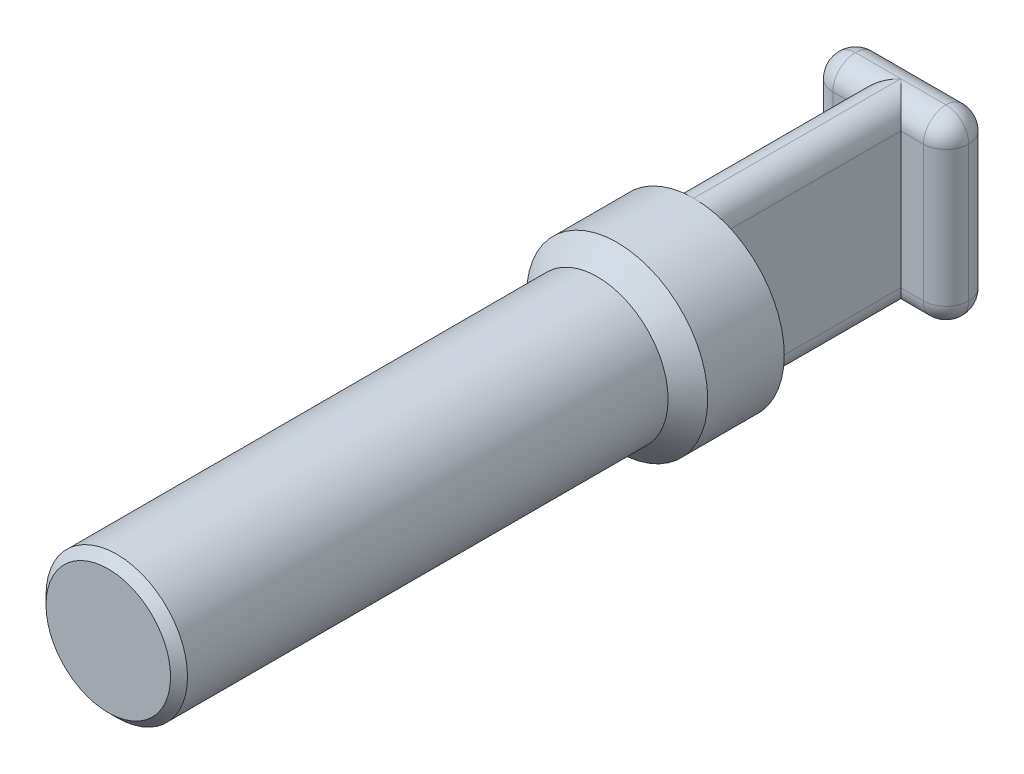
ISO-10303-21;
HEADER;
FILE_DESCRIPTION(('STEP AP214'),'2;1');
FILE_NAME('part.step','',(''),(''),'','','');
FILE_SCHEMA(('AUTOMOTIVE_DESIGN { 1 0 10303 214 1 1 1 1 }'));
ENDSEC;
DATA;
#1=APPLICATION_CONTEXT('core data for automotive mechanical design processes');
#2=APPLICATION_PROTOCOL_DEFINITION('international standard','automotive_design',2000,#1);
#3=PRODUCT_CONTEXT('',#1,'mechanical');
#4=PRODUCT('Part','Part','',(#3));
#5=PRODUCT_RELATED_PRODUCT_CATEGORY('part','',(#4));
#6=PRODUCT_DEFINITION_FORMATION('','',#4);
#7=PRODUCT_DEFINITION_CONTEXT('part definition',#1,'design');
#8=PRODUCT_DEFINITION('design','',#6,#7);
#9=PRODUCT_DEFINITION_SHAPE('','',#8);
#10=(LENGTH_UNIT() NAMED_UNIT(*) SI_UNIT(.MILLI.,.METRE.));
#11=(NAMED_UNIT(*) PLANE_ANGLE_UNIT() SI_UNIT($,.RADIAN.));
#12=(NAMED_UNIT(*) SI_UNIT($,.STERADIAN.) SOLID_ANGLE_UNIT());
#13=UNCERTAINTY_MEASURE_WITH_UNIT(LENGTH_MEASURE(1.E-05),#10,'distance_accuracy_value','');
#14=(GEOMETRIC_REPRESENTATION_CONTEXT(3) GLOBAL_UNCERTAINTY_ASSIGNED_CONTEXT((#13)) GLOBAL_UNIT_ASSIGNED_CONTEXT((#10,
#11,#12)) REPRESENTATION_CONTEXT('',''));
#15=CARTESIAN_POINT('',(0.,0.,0.));
#16=DIRECTION('',(0.,0.,1.));
#17=DIRECTION('',(1.,0.,0.));
#18=AXIS2_PLACEMENT_3D('',#15,#16,#17);
#19=CARTESIAN_POINT('',(-1.016,4.064,-18.288));
#20=DIRECTION('',(1.,0.,0.));
#21=DIRECTION('',(0.,0.,-1.));
#22=AXIS2_PLACEMENT_3D('',#19,#20,#21);
#23=PLANE('',#22);
#24=DIRECTION('',(0.,1.,0.));
#25=VECTOR('',#24,1.);
#26=CARTESIAN_POINT('',(-1.016,4.064,-16.256));
#27=LINE('',#26,#25);
#28=CARTESIAN_POINT('',(-1.016,-3.048,-16.256));
#29=VERTEX_POINT('',#28);
#30=CARTESIAN_POINT('',(-1.016,3.048,-16.256));
#31=VERTEX_POINT('',#30);
#32=EDGE_CURVE('E266',#29,#31,#27,.T.);
#33=ORIENTED_EDGE('',*,*,#32,.F.);
#34=DIRECTION('',(0.,0.,1.));
#35=VECTOR('',#34,1.);
#36=CARTESIAN_POINT('',(-1.016,-3.048,-18.288));
#37=LINE('',#36,#35);
#38=CARTESIAN_POINT('',(-1.016,-3.048,-7.98195));
#39=VERTEX_POINT('',#38);
#40=EDGE_CURVE('E157',#29,#39,#37,.T.);
#41=ORIENTED_EDGE('',*,*,#40,.T.);
#42=DIRECTION('',(0.,1.,0.));
#43=VECTOR('',#42,1.);
#44=CARTESIAN_POINT('',(-1.016,4.064,-7.98195));
#45=LINE('',#44,#43);
#46=CARTESIAN_POINT('',(-1.016,3.048,-7.98195));
#47=VERTEX_POINT('',#46);
#48=EDGE_CURVE('E148',#39,#47,#45,.T.);
#49=ORIENTED_EDGE('',*,*,#48,.T.);
#50=DIRECTION('',(0.,0.,1.));
#51=VECTOR('',#50,1.);
#52=CARTESIAN_POINT('',(-1.016,3.048,-18.288));
#53=LINE('',#52,#51);
#54=EDGE_CURVE('E154',#47,#31,#53,.F.);
#55=ORIENTED_EDGE('',*,*,#54,.T.);
#56=EDGE_LOOP('',(#33,#41,#49,#55));
#57=FACE_BOUND('',#56,.T.);
#58=ADVANCED_FACE('F36',(#57),#23,.F.);
#59=CARTESIAN_POINT('',(1.016,4.064,-18.288));
#60=DIRECTION('',(-1.,0.,0.));
#61=DIRECTION('',(0.,0.,1.));
#62=AXIS2_PLACEMENT_3D('',#59,#60,#61);
#63=PLANE('',#62);
#64=DIRECTION('',(0.,-1.,0.));
#65=VECTOR('',#64,1.);
#66=CARTESIAN_POINT('',(1.016,4.064,-7.98195));
#67=LINE('',#66,#65);
#68=CARTESIAN_POINT('',(1.016,3.048,-7.98195));
#69=VERTEX_POINT('',#68);
#70=CARTESIAN_POINT('',(1.016,-3.048,-7.98195));
#71=VERTEX_POINT('',#70);
#72=EDGE_CURVE('E158',#69,#71,#67,.T.);
#73=ORIENTED_EDGE('',*,*,#72,.T.);
#74=DIRECTION('',(0.,0.,1.));
#75=VECTOR('',#74,1.);
#76=CARTESIAN_POINT('',(1.016,-3.048,-18.288));
#77=LINE('',#76,#75);
#78=CARTESIAN_POINT('',(1.016,-3.048,-16.256));
#79=VERTEX_POINT('',#78);
#80=EDGE_CURVE('E166',#71,#79,#77,.F.);
#81=ORIENTED_EDGE('',*,*,#80,.T.);
#82=DIRECTION('',(0.,-1.,0.));
#83=VECTOR('',#82,1.);
#84=CARTESIAN_POINT('',(1.016,4.064,-16.256));
#85=LINE('',#84,#83);
#86=CARTESIAN_POINT('',(1.016,3.048,-16.256));
#87=VERTEX_POINT('',#86);
#88=EDGE_CURVE('E275',#87,#79,#85,.T.);
#89=ORIENTED_EDGE('',*,*,#88,.F.);
#90=DIRECTION('',(0.,0.,1.));
#91=VECTOR('',#90,1.);
#92=CARTESIAN_POINT('',(1.016,3.048,-18.288));
#93=LINE('',#92,#91);
#94=EDGE_CURVE('E170',#87,#69,#93,.T.);
#95=ORIENTED_EDGE('',*,*,#94,.T.);
#96=EDGE_LOOP('',(#73,#81,#89,#95));
#97=FACE_BOUND('',#96,.T.);
#98=ADVANCED_FACE('F313',(#97),#63,.F.);
#99=CARTESIAN_POINT('',(0.,4.064,-7.98195));
#100=DIRECTION('',(0.,0.,-1.));
#101=DIRECTION('',(-1.,0.,0.));
#102=AXIS2_PLACEMENT_3D('',#99,#100,#101);
#103=PLANE('',#102);
#104=ORIENTED_EDGE('',*,*,#72,.F.);
#105=CARTESIAN_POINT('',(0.,3.048,-7.98195));
#106=DIRECTION('',(0.,0.,-1.));
#107=DIRECTION('',(-1.,0.,0.));
#108=AXIS2_PLACEMENT_3D('',#105,#106,#107);
#109=CIRCLE('',#108,1.016);
#110=CARTESIAN_POINT('',(0.,4.064,-7.98195));
#111=VERTEX_POINT('',#110);
#112=EDGE_CURVE('E47',#69,#111,#109,.F.);
#113=ORIENTED_EDGE('',*,*,#112,.T.);
#114=CARTESIAN_POINT('',(0.,0.,-7.98195));
#115=DIRECTION('',(0.,0.,1.));
#116=DIRECTION('',(1.,0.,0.));
#117=AXIS2_PLACEMENT_3D('',#114,#115,#116);
#118=CIRCLE('',#117,4.064);
#119=CARTESIAN_POINT('',(0.,-4.064,-7.98195));
#120=VERTEX_POINT('',#119);
#121=EDGE_CURVE('E269',#120,#111,#118,.T.);
#122=ORIENTED_EDGE('',*,*,#121,.F.);
#123=CARTESIAN_POINT('',(0.,-3.048,-7.98195));
#124=DIRECTION('',(0.,0.,-1.));
#125=DIRECTION('',(-1.,0.,0.));
#126=AXIS2_PLACEMENT_3D('',#123,#124,#125);
#127=CIRCLE('',#126,1.016);
#128=EDGE_CURVE('E168',#120,#71,#127,.F.);
#129=ORIENTED_EDGE('',*,*,#128,.T.);
#130=EDGE_LOOP('',(#104,#113,#122,#129));
#131=FACE_BOUND('',#130,.T.);
#132=ADVANCED_FACE('F318',(#131),#103,.T.);
#133=CARTESIAN_POINT('',(0.,0.,0.));
#134=DIRECTION('',(0.,0.,1.));
#135=DIRECTION('',(1.,0.,0.));
#136=AXIS2_PLACEMENT_3D('',#133,#134,#135);
#137=CYLINDRICAL_SURFACE('',#136,4.064);
#138=CARTESIAN_POINT('',(0.,0.,-4.5466));
#139=DIRECTION('',(0.,0.,1.));
#140=DIRECTION('',(1.,0.,0.));
#141=AXIS2_PLACEMENT_3D('',#138,#139,#140);
#142=CIRCLE('',#141,4.064);
#143=CARTESIAN_POINT('',(4.064,0.,-4.5466));
#144=VERTEX_POINT('',#143);
#145=EDGE_CURVE('E280',#144,#144,#142,.T.);
#146=ORIENTED_EDGE('',*,*,#145,.F.);
#147=EDGE_LOOP('',(#146));
#148=FACE_BOUND('',#147,.T.);
#149=ORIENTED_EDGE('',*,*,#121,.T.);
#150=EDGE_CURVE('E55',#111,#120,#118,.T.);
#151=ORIENTED_EDGE('',*,*,#150,.T.);
#152=EDGE_LOOP('',(#149,#151));
#153=FACE_BOUND('',#152,.T.);
#154=ADVANCED_FACE('F407',(#148,#153),#137,.T.);
#155=CARTESIAN_POINT('',(0.,0.,-4.5466));
#156=DIRECTION('',(0.,0.,-1.));
#157=DIRECTION('',(-1.,0.,0.));
#158=AXIS2_PLACEMENT_3D('',#155,#156,#157);
#159=CONICAL_SURFACE('',#158,4.064,0.78539816339745);
#160=CARTESIAN_POINT('',(0.,0.,-3.6576));
#161=DIRECTION('',(0.,0.,1.));
#162=DIRECTION('',(1.,0.,0.));
#163=AXIS2_PLACEMENT_3D('',#160,#161,#162);
#164=CIRCLE('',#163,3.175);
#165=CARTESIAN_POINT('',(3.175,0.,-3.6576));
#166=VERTEX_POINT('',#165);
#167=EDGE_CURVE('E277',#166,#166,#164,.T.);
#168=ORIENTED_EDGE('',*,*,#167,.F.);
#169=EDGE_LOOP('',(#168));
#170=FACE_BOUND('',#169,.T.);
#171=ORIENTED_EDGE('',*,*,#145,.T.);
#172=EDGE_LOOP('',(#171));
#173=FACE_BOUND('',#172,.T.);
#174=ADVANCED_FACE('F403',(#170,#173),#159,.T.);
#175=CARTESIAN_POINT('',(0.,0.,0.));
#176=DIRECTION('',(0.,0.,1.));
#177=DIRECTION('',(1.,0.,0.));
#178=AXIS2_PLACEMENT_3D('',#175,#176,#177);
#179=CYLINDRICAL_SURFACE('',#178,3.175);
#180=CARTESIAN_POINT('',(0.,0.,17.907));
#181=DIRECTION('',(0.,0.,-1.));
#182=DIRECTION('',(-1.,0.,0.));
#183=AXIS2_PLACEMENT_3D('',#180,#181,#182);
#184=CIRCLE('',#183,3.175);
#185=CARTESIAN_POINT('',(-3.175,0.,17.907));
#186=VERTEX_POINT('',#185);
#187=EDGE_CURVE('E159',#186,#186,#184,.T.);
#188=ORIENTED_EDGE('',*,*,#187,.T.);
#189=EDGE_LOOP('',(#188));
#190=FACE_BOUND('',#189,.T.);
#191=ORIENTED_EDGE('',*,*,#167,.T.);
#192=EDGE_LOOP('',(#191));
#193=FACE_BOUND('',#192,.T.);
#194=ADVANCED_FACE('F399',(#190,#193),#179,.T.);
#195=CARTESIAN_POINT('',(0.,3.175,18.288));
#196=DIRECTION('',(0.,0.,-1.));
#197=DIRECTION('',(-1.,0.,0.));
#198=AXIS2_PLACEMENT_3D('',#195,#196,#197);
#199=PLANE('',#198);
#200=CARTESIAN_POINT('',(0.,0.,18.288));
#201=DIRECTION('',(0.,0.,-1.));
#202=DIRECTION('',(-1.,0.,0.));
#203=AXIS2_PLACEMENT_3D('',#200,#201,#202);
#204=CIRCLE('',#203,2.794);
#205=CARTESIAN_POINT('',(-2.794,0.,18.288));
#206=VERTEX_POINT('',#205);
#207=EDGE_CURVE('E283',#206,#206,#204,.F.);
#208=ORIENTED_EDGE('',*,*,#207,.T.);
#209=EDGE_LOOP('',(#208));
#210=FACE_BOUND('',#209,.T.);
#211=ADVANCED_FACE('F396',(#210),#199,.F.);
#212=CARTESIAN_POINT('',(0.,0.,18.288));
#213=DIRECTION('',(0.,0.,-1.));
#214=DIRECTION('',(-1.,0.,0.));
#215=AXIS2_PLACEMENT_3D('',#212,#213,#214);
#216=CONICAL_SURFACE('',#215,2.794,0.785398163397447);
#217=ORIENTED_EDGE('',*,*,#187,.F.);
#218=EDGE_LOOP('',(#217));
#219=FACE_BOUND('',#218,.T.);
#220=ORIENTED_EDGE('',*,*,#207,.F.);
#221=EDGE_LOOP('',(#220));
#222=FACE_BOUND('',#221,.T.);
#223=ADVANCED_FACE('F395',(#219,#222),#216,.T.);
#224=ORIENTED_EDGE('',*,*,#48,.F.);
#225=CARTESIAN_POINT('',(0.,-3.048,-7.98195));
#226=DIRECTION('',(0.,0.,-1.));
#227=DIRECTION('',(-1.,0.,0.));
#228=AXIS2_PLACEMENT_3D('',#225,#226,#227);
#229=CIRCLE('',#228,1.016);
#230=EDGE_CURVE('E176',#39,#120,#229,.F.);
#231=ORIENTED_EDGE('',*,*,#230,.T.);
#232=ORIENTED_EDGE('',*,*,#150,.F.);
#233=CARTESIAN_POINT('',(0.,3.048,-7.98195));
#234=DIRECTION('',(0.,0.,-1.));
#235=DIRECTION('',(-1.,0.,0.));
#236=AXIS2_PLACEMENT_3D('',#233,#234,#235);
#237=CIRCLE('',#236,1.016);
#238=EDGE_CURVE('E11',#111,#47,#237,.F.);
#239=ORIENTED_EDGE('',*,*,#238,.T.);
#240=EDGE_LOOP('',(#224,#231,#232,#239));
#241=FACE_BOUND('',#240,.T.);
#242=ADVANCED_FACE('F147',(#241),#103,.T.);
#243=CARTESIAN_POINT('',(-1.016,-4.064,-18.288));
#244=DIRECTION('',(0.,0.,1.));
#245=DIRECTION('',(1.,0.,0.));
#246=AXIS2_PLACEMENT_3D('',#243,#244,#245);
#247=PLANE('',#246);
#248=DIRECTION('',(0.,-1.,0.));
#249=VECTOR('',#248,1.);
#250=CARTESIAN_POINT('',(2.032,-4.064,-18.288));
#251=LINE('',#250,#249);
#252=CARTESIAN_POINT('',(2.032,3.048,-18.288));
#253=VERTEX_POINT('',#252);
#254=CARTESIAN_POINT('',(2.032,-3.048,-18.288));
#255=VERTEX_POINT('',#254);
#256=EDGE_CURVE('E293',#253,#255,#251,.T.);
#257=ORIENTED_EDGE('',*,*,#256,.T.);
#258=DIRECTION('',(-1.,0.,0.));
#259=VECTOR('',#258,1.);
#260=CARTESIAN_POINT('',(-1.016,-3.048,-18.288));
#261=LINE('',#260,#259);
#262=CARTESIAN_POINT('',(-2.032,-3.048,-18.288));
#263=VERTEX_POINT('',#262);
#264=EDGE_CURVE('E295',#255,#263,#261,.T.);
#265=ORIENTED_EDGE('',*,*,#264,.T.);
#266=DIRECTION('',(0.,1.,0.));
#267=VECTOR('',#266,1.);
#268=CARTESIAN_POINT('',(-2.032,4.064,-18.288));
#269=LINE('',#268,#267);
#270=CARTESIAN_POINT('',(-2.032,3.048,-18.288));
#271=VERTEX_POINT('',#270);
#272=EDGE_CURVE('E102',#263,#271,#269,.T.);
#273=ORIENTED_EDGE('',*,*,#272,.T.);
#274=DIRECTION('',(1.,0.,0.));
#275=VECTOR('',#274,1.);
#276=CARTESIAN_POINT('',(-1.016,3.048,-18.288));
#277=LINE('',#276,#275);
#278=EDGE_CURVE('E290',#271,#253,#277,.T.);
#279=ORIENTED_EDGE('',*,*,#278,.T.);
#280=EDGE_LOOP('',(#257,#265,#273,#279));
#281=FACE_BOUND('',#280,.T.);
#282=ADVANCED_FACE('F374',(#281),#247,.F.);
#283=CARTESIAN_POINT('',(3.048,-4.064,-16.256));
#284=DIRECTION('',(0.,0.,-1.));
#285=DIRECTION('',(-1.,0.,0.));
#286=AXIS2_PLACEMENT_3D('',#283,#284,#285);
#287=PLANE('',#286);
#288=ORIENTED_EDGE('',*,*,#88,.T.);
#289=DIRECTION('',(-1.,0.,0.));
#290=VECTOR('',#289,1.);
#291=CARTESIAN_POINT('',(3.048,-3.048,-16.256));
#292=LINE('',#291,#290);
#293=CARTESIAN_POINT('',(2.032,-3.048,-16.256));
#294=VERTEX_POINT('',#293);
#295=EDGE_CURVE('E301',#79,#294,#292,.F.);
#296=ORIENTED_EDGE('',*,*,#295,.T.);
#297=DIRECTION('',(0.,-1.,0.));
#298=VECTOR('',#297,1.);
#299=CARTESIAN_POINT('',(2.032,4.064,-16.256));
#300=LINE('',#299,#298);
#301=CARTESIAN_POINT('',(2.032,3.048,-16.256));
#302=VERTEX_POINT('',#301);
#303=EDGE_CURVE('E299',#294,#302,#300,.F.);
#304=ORIENTED_EDGE('',*,*,#303,.T.);
#305=DIRECTION('',(1.,0.,0.));
#306=VECTOR('',#305,1.);
#307=CARTESIAN_POINT('',(3.048,3.048,-16.256));
#308=LINE('',#307,#306);
#309=EDGE_CURVE('E297',#302,#87,#308,.F.);
#310=ORIENTED_EDGE('',*,*,#309,.T.);
#311=EDGE_LOOP('',(#288,#296,#304,#310));
#312=FACE_BOUND('',#311,.T.);
#313=ADVANCED_FACE('F356',(#312),#287,.F.);
#314=DIRECTION('',(0.,1.,0.));
#315=VECTOR('',#314,1.);
#316=CARTESIAN_POINT('',(-2.032,-4.064,-16.256));
#317=LINE('',#316,#315);
#318=CARTESIAN_POINT('',(-2.032,3.048,-16.256));
#319=VERTEX_POINT('',#318);
#320=CARTESIAN_POINT('',(-2.032,-3.048,-16.256));
#321=VERTEX_POINT('',#320);
#322=EDGE_CURVE('E306',#319,#321,#317,.F.);
#323=ORIENTED_EDGE('',*,*,#322,.T.);
#324=DIRECTION('',(-1.,0.,0.));
#325=VECTOR('',#324,1.);
#326=CARTESIAN_POINT('',(3.048,-3.048,-16.256));
#327=LINE('',#326,#325);
#328=EDGE_CURVE('E308',#321,#29,#327,.F.);
#329=ORIENTED_EDGE('',*,*,#328,.T.);
#330=ORIENTED_EDGE('',*,*,#32,.T.);
#331=DIRECTION('',(1.,0.,0.));
#332=VECTOR('',#331,1.);
#333=CARTESIAN_POINT('',(3.048,3.048,-16.256));
#334=LINE('',#333,#332);
#335=EDGE_CURVE('E304',#31,#319,#334,.F.);
#336=ORIENTED_EDGE('',*,*,#335,.T.);
#337=EDGE_LOOP('',(#323,#329,#330,#336));
#338=FACE_BOUND('',#337,.T.);
#339=ADVANCED_FACE('F343',(#338),#287,.F.);
#340=CARTESIAN_POINT('',(2.032,3.048,-17.272));
#341=DIRECTION('',(0.,0.,1.));
#342=DIRECTION('',(1.,0.,0.));
#343=AXIS2_PLACEMENT_3D('',#340,#341,#342);
#344=SPHERICAL_SURFACE('',#343,1.016);
#345=CARTESIAN_POINT('',(2.032,3.048,-17.272));
#346=DIRECTION('',(1.,0.,0.));
#347=DIRECTION('',(0.,0.,-1.));
#348=AXIS2_PLACEMENT_3D('',#345,#346,#347);
#349=CIRCLE('',#348,1.016);
#350=CARTESIAN_POINT('',(2.032,4.064,-17.272));
#351=VERTEX_POINT('',#350);
#352=EDGE_CURVE('E261',#302,#351,#349,.F.);
#353=ORIENTED_EDGE('',*,*,#352,.F.);
#354=CARTESIAN_POINT('',(2.032,3.048,-17.272));
#355=DIRECTION('',(0.,1.,0.));
#356=DIRECTION('',(0.,0.,1.));
#357=AXIS2_PLACEMENT_3D('',#354,#355,#356);
#358=CIRCLE('',#357,1.016);
#359=CARTESIAN_POINT('',(3.048,3.048,-17.272));
#360=VERTEX_POINT('',#359);
#361=EDGE_CURVE('E94',#360,#302,#358,.F.);
#362=ORIENTED_EDGE('',*,*,#361,.F.);
#363=CARTESIAN_POINT('',(2.032,3.048,-17.272));
#364=DIRECTION('',(0.,0.,-1.));
#365=DIRECTION('',(-1.,0.,0.));
#366=AXIS2_PLACEMENT_3D('',#363,#364,#365);
#367=CIRCLE('',#366,1.016);
#368=EDGE_CURVE('E90',#351,#360,#367,.T.);
#369=ORIENTED_EDGE('',*,*,#368,.F.);
#370=EDGE_LOOP('',(#353,#362,#369));
#371=FACE_BOUND('',#370,.T.);
#372=ADVANCED_FACE('F38',(#371),#344,.T.);
#373=CARTESIAN_POINT('',(0.,3.048,-18.288));
#374=DIRECTION('',(0.,0.,1.));
#375=DIRECTION('',(1.,0.,0.));
#376=AXIS2_PLACEMENT_3D('',#373,#374,#375);
#377=CYLINDRICAL_SURFACE('',#376,1.016);
#378=DIRECTION('',(0.,0.,1.));
#379=VECTOR('',#378,1.);
#380=CARTESIAN_POINT('',(0.,4.064,-18.288));
#381=LINE('',#380,#379);
#382=CARTESIAN_POINT('',(0.,4.064,-17.272));
#383=VERTEX_POINT('',#382);
#384=EDGE_CURVE('E40',#111,#383,#381,.F.);
#385=ORIENTED_EDGE('',*,*,#384,.F.);
#386=ORIENTED_EDGE('',*,*,#112,.F.);
#387=ORIENTED_EDGE('',*,*,#94,.F.);
#388=CARTESIAN_POINT('',(0.,3.048,-17.272));
#389=DIRECTION('',(0.707106781186547,0.,-0.707106781186547));
#390=DIRECTION('',(0.707106781186547,0.,0.707106781186547));
#391=AXIS2_PLACEMENT_3D('',#388,#389,#390);
#392=ELLIPSE('',#391,1.43684097937106,1.016);
#393=EDGE_CURVE('E258',#383,#87,#392,.T.);
#394=ORIENTED_EDGE('',*,*,#393,.F.);
#395=EDGE_LOOP('',(#385,#386,#387,#394));
#396=FACE_BOUND('',#395,.T.);
#397=ADVANCED_FACE('F321',(#396),#377,.T.);
#398=CARTESIAN_POINT('',(0.,3.048,-18.288));
#399=DIRECTION('',(0.,0.,1.));
#400=DIRECTION('',(1.,0.,0.));
#401=AXIS2_PLACEMENT_3D('',#398,#399,#400);
#402=CYLINDRICAL_SURFACE('',#401,1.016);
#403=ORIENTED_EDGE('',*,*,#238,.F.);
#404=ORIENTED_EDGE('',*,*,#384,.T.);
#405=CARTESIAN_POINT('',(0.,3.048,-17.272));
#406=DIRECTION('',(0.707106781186547,0.,0.707106781186547));
#407=DIRECTION('',(0.707106781186547,0.,-0.707106781186547));
#408=AXIS2_PLACEMENT_3D('',#405,#406,#407);
#409=ELLIPSE('',#408,1.43684097937106,1.016);
#410=EDGE_CURVE('E164',#31,#383,#409,.F.);
#411=ORIENTED_EDGE('',*,*,#410,.F.);
#412=ORIENTED_EDGE('',*,*,#54,.F.);
#413=EDGE_LOOP('',(#403,#404,#411,#412));
#414=FACE_BOUND('',#413,.T.);
#415=ADVANCED_FACE('F162',(#414),#402,.T.);
#416=CARTESIAN_POINT('',(2.032,4.064,-17.272));
#417=DIRECTION('',(0.,1.,0.));
#418=DIRECTION('',(-1.,0.,0.));
#419=AXIS2_PLACEMENT_3D('',#416,#417,#418);
#420=CYLINDRICAL_SURFACE('',#419,1.016);
#421=ORIENTED_EDGE('',*,*,#361,.T.);
#422=ORIENTED_EDGE('',*,*,#303,.F.);
#423=CARTESIAN_POINT('',(2.032,-3.048,-17.272));
#424=DIRECTION('',(0.,-1.,0.));
#425=DIRECTION('',(0.,0.,-1.));
#426=AXIS2_PLACEMENT_3D('',#423,#424,#425);
#427=CIRCLE('',#426,1.016);
#428=CARTESIAN_POINT('',(3.048,-3.048,-17.272));
#429=VERTEX_POINT('',#428);
#430=EDGE_CURVE('E254',#429,#294,#427,.T.);
#431=ORIENTED_EDGE('',*,*,#430,.F.);
#432=DIRECTION('',(0.,-1.,0.));
#433=VECTOR('',#432,1.);
#434=CARTESIAN_POINT('',(3.048,-4.064,-17.272));
#435=LINE('',#434,#433);
#436=EDGE_CURVE('E248',#360,#429,#435,.T.);
#437=ORIENTED_EDGE('',*,*,#436,.F.);
#438=EDGE_LOOP('',(#421,#422,#431,#437));
#439=FACE_BOUND('',#438,.T.);
#440=ADVANCED_FACE('F357',(#439),#420,.T.);
#441=CARTESIAN_POINT('',(2.032,3.048,-17.272));
#442=DIRECTION('',(0.,0.,1.));
#443=DIRECTION('',(1.,0.,0.));
#444=AXIS2_PLACEMENT_3D('',#441,#442,#443);
#445=SPHERICAL_SURFACE('',#444,1.016);
#446=CARTESIAN_POINT('',(2.032,3.048,-17.272));
#447=DIRECTION('',(1.,0.,0.));
#448=DIRECTION('',(0.,0.,-1.));
#449=AXIS2_PLACEMENT_3D('',#446,#447,#448);
#450=CIRCLE('',#449,1.016);
#451=EDGE_CURVE('E242',#351,#253,#450,.F.);
#452=ORIENTED_EDGE('',*,*,#451,.F.);
#453=ORIENTED_EDGE('',*,*,#368,.T.);
#454=CARTESIAN_POINT('',(2.032,3.048,-17.272));
#455=DIRECTION('',(0.,1.,0.));
#456=DIRECTION('',(0.,0.,1.));
#457=AXIS2_PLACEMENT_3D('',#454,#455,#456);
#458=CIRCLE('',#457,1.016);
#459=EDGE_CURVE('E245',#253,#360,#458,.F.);
#460=ORIENTED_EDGE('',*,*,#459,.F.);
#461=EDGE_LOOP('',(#452,#453,#460));
#462=FACE_BOUND('',#461,.T.);
#463=ADVANCED_FACE('F376',(#462),#445,.T.);
#464=CARTESIAN_POINT('',(1.016,3.048,-17.272));
#465=DIRECTION('',(1.,0.,0.));
#466=DIRECTION('',(0.,0.,-1.));
#467=AXIS2_PLACEMENT_3D('',#464,#465,#466);
#468=CYLINDRICAL_SURFACE('',#467,1.016);
#469=ORIENTED_EDGE('',*,*,#309,.F.);
#470=ORIENTED_EDGE('',*,*,#352,.T.);
#471=DIRECTION('',(1.,0.,0.));
#472=VECTOR('',#471,1.);
#473=CARTESIAN_POINT('',(1.016,4.064,-17.272));
#474=LINE('',#473,#472);
#475=EDGE_CURVE('E239',#383,#351,#474,.T.);
#476=ORIENTED_EDGE('',*,*,#475,.F.);
#477=ORIENTED_EDGE('',*,*,#393,.T.);
#478=EDGE_LOOP('',(#469,#470,#476,#477));
#479=FACE_BOUND('',#478,.T.);
#480=ADVANCED_FACE('F328',(#479),#468,.T.);
#481=CARTESIAN_POINT('',(1.016,3.048,-17.272));
#482=DIRECTION('',(1.,0.,0.));
#483=DIRECTION('',(0.,0.,-1.));
#484=AXIS2_PLACEMENT_3D('',#481,#482,#483);
#485=CYLINDRICAL_SURFACE('',#484,1.016);
#486=ORIENTED_EDGE('',*,*,#335,.F.);
#487=ORIENTED_EDGE('',*,*,#410,.T.);
#488=DIRECTION('',(1.,0.,0.));
#489=VECTOR('',#488,1.);
#490=CARTESIAN_POINT('',(1.016,4.064,-17.272));
#491=LINE('',#490,#489);
#492=CARTESIAN_POINT('',(-2.032,4.064,-17.272));
#493=VERTEX_POINT('',#492);
#494=EDGE_CURVE('E236',#493,#383,#491,.T.);
#495=ORIENTED_EDGE('',*,*,#494,.F.);
#496=CARTESIAN_POINT('',(-2.032,3.048,-17.272));
#497=DIRECTION('',(-1.,0.,0.));
#498=DIRECTION('',(0.,0.,1.));
#499=AXIS2_PLACEMENT_3D('',#496,#497,#498);
#500=CIRCLE('',#499,1.016);
#501=EDGE_CURVE('E233',#319,#493,#500,.T.);
#502=ORIENTED_EDGE('',*,*,#501,.F.);
#503=EDGE_LOOP('',(#486,#487,#495,#502));
#504=FACE_BOUND('',#503,.T.);
#505=ADVANCED_FACE('F326',(#504),#485,.T.);
#506=CARTESIAN_POINT('',(0.,-3.048,-18.288));
#507=DIRECTION('',(0.,0.,1.));
#508=DIRECTION('',(1.,0.,0.));
#509=AXIS2_PLACEMENT_3D('',#506,#507,#508);
#510=CYLINDRICAL_SURFACE('',#509,1.016);
#511=ORIENTED_EDGE('',*,*,#80,.F.);
#512=ORIENTED_EDGE('',*,*,#128,.F.);
#513=DIRECTION('',(0.,0.,1.));
#514=VECTOR('',#513,1.);
#515=CARTESIAN_POINT('',(0.,-4.064,-18.288));
#516=LINE('',#515,#514);
#517=CARTESIAN_POINT('',(0.,-4.064,-17.272));
#518=VERTEX_POINT('',#517);
#519=EDGE_CURVE('E230',#518,#120,#516,.T.);
#520=ORIENTED_EDGE('',*,*,#519,.F.);
#521=CARTESIAN_POINT('',(0.,-3.048,-17.272));
#522=DIRECTION('',(-0.707106781186547,0.,0.707106781186547));
#523=DIRECTION('',(-0.707106781186547,0.,-0.707106781186547));
#524=AXIS2_PLACEMENT_3D('',#521,#522,#523);
#525=ELLIPSE('',#524,1.43684097937106,1.016);
#526=EDGE_CURVE('E227',#79,#518,#525,.F.);
#527=ORIENTED_EDGE('',*,*,#526,.F.);
#528=EDGE_LOOP('',(#511,#512,#520,#527));
#529=FACE_BOUND('',#528,.T.);
#530=ADVANCED_FACE('F352',(#529),#510,.T.);
#531=CARTESIAN_POINT('',(2.032,-3.048,-17.272));
#532=DIRECTION('',(0.,0.,1.));
#533=DIRECTION('',(1.,0.,0.));
#534=AXIS2_PLACEMENT_3D('',#531,#532,#533);
#535=SPHERICAL_SURFACE('',#534,1.016);
#536=CARTESIAN_POINT('',(2.032,-3.048,-17.272));
#537=DIRECTION('',(0.,0.,1.));
#538=DIRECTION('',(1.,0.,0.));
#539=AXIS2_PLACEMENT_3D('',#536,#537,#538);
#540=CIRCLE('',#539,1.016);
#541=CARTESIAN_POINT('',(2.032,-4.064,-17.272));
#542=VERTEX_POINT('',#541);
#543=EDGE_CURVE('E251',#429,#542,#540,.F.);
#544=ORIENTED_EDGE('',*,*,#543,.F.);
#545=ORIENTED_EDGE('',*,*,#430,.T.);
#546=CARTESIAN_POINT('',(2.032,-3.048,-17.272));
#547=DIRECTION('',(1.,0.,0.));
#548=DIRECTION('',(0.,0.,-1.));
#549=AXIS2_PLACEMENT_3D('',#546,#547,#548);
#550=CIRCLE('',#549,1.016);
#551=EDGE_CURVE('E225',#542,#294,#550,.F.);
#552=ORIENTED_EDGE('',*,*,#551,.F.);
#553=EDGE_LOOP('',(#544,#545,#552));
#554=FACE_BOUND('',#553,.T.);
#555=ADVANCED_FACE('F360',(#554),#535,.T.);
#556=CARTESIAN_POINT('',(2.032,-4.064,-17.272));
#557=DIRECTION('',(0.,1.,0.));
#558=DIRECTION('',(-1.,0.,0.));
#559=AXIS2_PLACEMENT_3D('',#556,#557,#558);
#560=CYLINDRICAL_SURFACE('',#559,1.016);
#561=ORIENTED_EDGE('',*,*,#459,.T.);
#562=ORIENTED_EDGE('',*,*,#436,.T.);
#563=CARTESIAN_POINT('',(2.032,-3.048,-17.272));
#564=DIRECTION('',(0.,-1.,0.));
#565=DIRECTION('',(1.,0.,0.));
#566=AXIS2_PLACEMENT_3D('',#563,#564,#565);
#567=CIRCLE('',#566,1.016);
#568=EDGE_CURVE('E222',#255,#429,#567,.T.);
#569=ORIENTED_EDGE('',*,*,#568,.F.);
#570=ORIENTED_EDGE('',*,*,#256,.F.);
#571=EDGE_LOOP('',(#561,#562,#569,#570));
#572=FACE_BOUND('',#571,.T.);
#573=ADVANCED_FACE('F366',(#572),#560,.T.);
#574=CARTESIAN_POINT('',(-1.016,3.048,-17.272));
#575=DIRECTION('',(1.,0.,0.));
#576=DIRECTION('',(0.,0.,-1.));
#577=AXIS2_PLACEMENT_3D('',#574,#575,#576);
#578=CYLINDRICAL_SURFACE('',#577,1.016);
#579=CARTESIAN_POINT('',(-2.032,3.048,-17.272));
#580=DIRECTION('',(-1.,0.,0.));
#581=DIRECTION('',(0.,0.,1.));
#582=AXIS2_PLACEMENT_3D('',#579,#580,#581);
#583=CIRCLE('',#582,1.016);
#584=EDGE_CURVE('E219',#493,#271,#583,.T.);
#585=ORIENTED_EDGE('',*,*,#584,.F.);
#586=ORIENTED_EDGE('',*,*,#494,.T.);
#587=ORIENTED_EDGE('',*,*,#475,.T.);
#588=ORIENTED_EDGE('',*,*,#451,.T.);
#589=ORIENTED_EDGE('',*,*,#278,.F.);
#590=EDGE_LOOP('',(#585,#586,#587,#588,#589));
#591=FACE_BOUND('',#590,.T.);
#592=ADVANCED_FACE('F332',(#591),#578,.T.);
#593=CARTESIAN_POINT('',(-2.032,3.048,-17.272));
#594=DIRECTION('',(0.,0.,1.));
#595=DIRECTION('',(1.,0.,0.));
#596=AXIS2_PLACEMENT_3D('',#593,#594,#595);
#597=SPHERICAL_SURFACE('',#596,1.016);
#598=ORIENTED_EDGE('',*,*,#501,.T.);
#599=CARTESIAN_POINT('',(-2.032,3.048,-17.272));
#600=DIRECTION('',(0.,0.,-1.));
#601=DIRECTION('',(-1.,0.,0.));
#602=AXIS2_PLACEMENT_3D('',#599,#600,#601);
#603=CIRCLE('',#602,1.016);
#604=CARTESIAN_POINT('',(-3.048,3.048,-17.272));
#605=VERTEX_POINT('',#604);
#606=EDGE_CURVE('E216',#605,#493,#603,.T.);
#607=ORIENTED_EDGE('',*,*,#606,.F.);
#608=CARTESIAN_POINT('',(-2.032,3.048,-17.272));
#609=DIRECTION('',(0.,1.,0.));
#610=DIRECTION('',(0.,0.,1.));
#611=AXIS2_PLACEMENT_3D('',#608,#609,#610);
#612=CIRCLE('',#611,1.016);
#613=EDGE_CURVE('E213',#319,#605,#612,.F.);
#614=ORIENTED_EDGE('',*,*,#613,.F.);
#615=EDGE_LOOP('',(#598,#607,#614));
#616=FACE_BOUND('',#615,.T.);
#617=ADVANCED_FACE('F337',(#616),#597,.T.);
#618=CARTESIAN_POINT('',(0.,-3.048,-18.288));
#619=DIRECTION('',(0.,0.,1.));
#620=DIRECTION('',(1.,0.,0.));
#621=AXIS2_PLACEMENT_3D('',#618,#619,#620);
#622=CYLINDRICAL_SURFACE('',#621,1.016);
#623=ORIENTED_EDGE('',*,*,#230,.F.);
#624=ORIENTED_EDGE('',*,*,#40,.F.);
#625=CARTESIAN_POINT('',(0.,-3.048,-17.272));
#626=DIRECTION('',(-0.707106781186547,0.,-0.707106781186547));
#627=DIRECTION('',(-0.707106781186547,0.,0.707106781186547));
#628=AXIS2_PLACEMENT_3D('',#625,#626,#627);
#629=ELLIPSE('',#628,1.43684097937106,1.016);
#630=EDGE_CURVE('E210',#518,#29,#629,.T.);
#631=ORIENTED_EDGE('',*,*,#630,.F.);
#632=ORIENTED_EDGE('',*,*,#519,.T.);
#633=EDGE_LOOP('',(#623,#624,#631,#632));
#634=FACE_BOUND('',#633,.T.);
#635=ADVANCED_FACE('F350',(#634),#622,.T.);
#636=CARTESIAN_POINT('',(1.016,-3.048,-17.272));
#637=DIRECTION('',(-1.,0.,0.));
#638=DIRECTION('',(0.,0.,1.));
#639=AXIS2_PLACEMENT_3D('',#636,#637,#638);
#640=CYLINDRICAL_SURFACE('',#639,1.016);
#641=ORIENTED_EDGE('',*,*,#295,.F.);
#642=ORIENTED_EDGE('',*,*,#526,.T.);
#643=DIRECTION('',(-1.,0.,0.));
#644=VECTOR('',#643,1.);
#645=CARTESIAN_POINT('',(1.016,-4.064,-17.272));
#646=LINE('',#645,#644);
#647=EDGE_CURVE('E205',#542,#518,#646,.T.);
#648=ORIENTED_EDGE('',*,*,#647,.F.);
#649=ORIENTED_EDGE('',*,*,#551,.T.);
#650=EDGE_LOOP('',(#641,#642,#648,#649));
#651=FACE_BOUND('',#650,.T.);
#652=ADVANCED_FACE('F438',(#651),#640,.T.);
#653=CARTESIAN_POINT('',(2.032,-3.048,-17.272));
#654=DIRECTION('',(0.,0.,1.));
#655=DIRECTION('',(1.,0.,0.));
#656=AXIS2_PLACEMENT_3D('',#653,#654,#655);
#657=SPHERICAL_SURFACE('',#656,1.016);
#658=ORIENTED_EDGE('',*,*,#568,.T.);
#659=ORIENTED_EDGE('',*,*,#543,.T.);
#660=CARTESIAN_POINT('',(2.032,-3.048,-17.272));
#661=DIRECTION('',(1.,0.,0.));
#662=DIRECTION('',(0.,0.,-1.));
#663=AXIS2_PLACEMENT_3D('',#660,#661,#662);
#664=CIRCLE('',#663,1.016);
#665=EDGE_CURVE('E202',#255,#542,#664,.F.);
#666=ORIENTED_EDGE('',*,*,#665,.F.);
#667=EDGE_LOOP('',(#658,#659,#666));
#668=FACE_BOUND('',#667,.T.);
#669=ADVANCED_FACE('F369',(#668),#657,.T.);
#670=CARTESIAN_POINT('',(-2.032,3.048,-17.272));
#671=DIRECTION('',(0.,0.,1.));
#672=DIRECTION('',(1.,0.,0.));
#673=AXIS2_PLACEMENT_3D('',#670,#671,#672);
#674=SPHERICAL_SURFACE('',#673,1.016);
#675=ORIENTED_EDGE('',*,*,#606,.T.);
#676=ORIENTED_EDGE('',*,*,#584,.T.);
#677=CARTESIAN_POINT('',(-2.032,3.048,-17.272));
#678=DIRECTION('',(0.,1.,0.));
#679=DIRECTION('',(-1.,0.,0.));
#680=AXIS2_PLACEMENT_3D('',#677,#678,#679);
#681=CIRCLE('',#680,1.016);
#682=EDGE_CURVE('E199',#605,#271,#681,.F.);
#683=ORIENTED_EDGE('',*,*,#682,.F.);
#684=EDGE_LOOP('',(#675,#676,#683));
#685=FACE_BOUND('',#684,.T.);
#686=ADVANCED_FACE('F433',(#685),#674,.T.);
#687=CARTESIAN_POINT('',(-2.032,4.064,-17.272));
#688=DIRECTION('',(0.,-1.,0.));
#689=DIRECTION('',(0.,0.,-1.));
#690=AXIS2_PLACEMENT_3D('',#687,#688,#689);
#691=CYLINDRICAL_SURFACE('',#690,1.016);
#692=ORIENTED_EDGE('',*,*,#322,.F.);
#693=ORIENTED_EDGE('',*,*,#613,.T.);
#694=DIRECTION('',(0.,1.,0.));
#695=VECTOR('',#694,1.);
#696=CARTESIAN_POINT('',(-3.048,4.064,-17.272));
#697=LINE('',#696,#695);
#698=CARTESIAN_POINT('',(-3.048,-3.048,-17.272));
#699=VERTEX_POINT('',#698);
#700=EDGE_CURVE('E196',#699,#605,#697,.T.);
#701=ORIENTED_EDGE('',*,*,#700,.F.);
#702=CARTESIAN_POINT('',(-2.032,-3.048,-17.272));
#703=DIRECTION('',(0.,-1.,0.));
#704=DIRECTION('',(0.,0.,-1.));
#705=AXIS2_PLACEMENT_3D('',#702,#703,#704);
#706=CIRCLE('',#705,1.016);
#707=EDGE_CURVE('E193',#321,#699,#706,.T.);
#708=ORIENTED_EDGE('',*,*,#707,.F.);
#709=EDGE_LOOP('',(#692,#693,#701,#708));
#710=FACE_BOUND('',#709,.T.);
#711=ADVANCED_FACE('F341',(#710),#691,.T.);
#712=CARTESIAN_POINT('',(1.016,-3.048,-17.272));
#713=DIRECTION('',(-1.,0.,0.));
#714=DIRECTION('',(0.,0.,1.));
#715=AXIS2_PLACEMENT_3D('',#712,#713,#714);
#716=CYLINDRICAL_SURFACE('',#715,1.016);
#717=DIRECTION('',(-1.,0.,0.));
#718=VECTOR('',#717,1.);
#719=CARTESIAN_POINT('',(1.016,-4.064,-17.272));
#720=LINE('',#719,#718);
#721=CARTESIAN_POINT('',(-2.032,-4.064,-17.272));
#722=VERTEX_POINT('',#721);
#723=EDGE_CURVE('E208',#518,#722,#720,.T.);
#724=ORIENTED_EDGE('',*,*,#723,.F.);
#725=ORIENTED_EDGE('',*,*,#630,.T.);
#726=ORIENTED_EDGE('',*,*,#328,.F.);
#727=CARTESIAN_POINT('',(-2.032,-3.048,-17.272));
#728=DIRECTION('',(-1.,0.,0.));
#729=DIRECTION('',(0.,0.,1.));
#730=AXIS2_PLACEMENT_3D('',#727,#728,#729);
#731=CIRCLE('',#730,1.016);
#732=EDGE_CURVE('E190',#722,#321,#731,.T.);
#733=ORIENTED_EDGE('',*,*,#732,.F.);
#734=EDGE_LOOP('',(#724,#725,#726,#733));
#735=FACE_BOUND('',#734,.T.);
#736=ADVANCED_FACE('F347',(#735),#716,.T.);
#737=CARTESIAN_POINT('',(-1.016,-3.048,-17.272));
#738=DIRECTION('',(-1.,0.,0.));
#739=DIRECTION('',(0.,0.,1.));
#740=AXIS2_PLACEMENT_3D('',#737,#738,#739);
#741=CYLINDRICAL_SURFACE('',#740,1.016);
#742=ORIENTED_EDGE('',*,*,#647,.T.);
#743=ORIENTED_EDGE('',*,*,#723,.T.);
#744=CARTESIAN_POINT('',(-2.032,-3.048,-17.272));
#745=DIRECTION('',(-1.,0.,0.));
#746=DIRECTION('',(0.,0.,1.));
#747=AXIS2_PLACEMENT_3D('',#744,#745,#746);
#748=CIRCLE('',#747,1.016);
#749=EDGE_CURVE('E187',#263,#722,#748,.T.);
#750=ORIENTED_EDGE('',*,*,#749,.F.);
#751=ORIENTED_EDGE('',*,*,#264,.F.);
#752=ORIENTED_EDGE('',*,*,#665,.T.);
#753=EDGE_LOOP('',(#742,#743,#750,#751,#752));
#754=FACE_BOUND('',#753,.T.);
#755=ADVANCED_FACE('F373',(#754),#741,.T.);
#756=CARTESIAN_POINT('',(-2.032,-4.064,-17.272));
#757=DIRECTION('',(0.,-1.,0.));
#758=DIRECTION('',(0.,0.,-1.));
#759=AXIS2_PLACEMENT_3D('',#756,#757,#758);
#760=CYLINDRICAL_SURFACE('',#759,1.016);
#761=ORIENTED_EDGE('',*,*,#682,.T.);
#762=ORIENTED_EDGE('',*,*,#272,.F.);
#763=CARTESIAN_POINT('',(-2.032,-3.048,-17.272));
#764=DIRECTION('',(0.,-1.,0.));
#765=DIRECTION('',(0.,0.,-1.));
#766=AXIS2_PLACEMENT_3D('',#763,#764,#765);
#767=CIRCLE('',#766,1.016);
#768=EDGE_CURVE('E185',#699,#263,#767,.T.);
#769=ORIENTED_EDGE('',*,*,#768,.F.);
#770=ORIENTED_EDGE('',*,*,#700,.T.);
#771=EDGE_LOOP('',(#761,#762,#769,#770));
#772=FACE_BOUND('',#771,.T.);
#773=ADVANCED_FACE('F422',(#772),#760,.T.);
#774=CARTESIAN_POINT('',(-2.032,-3.048,-17.272));
#775=DIRECTION('',(0.,0.,1.));
#776=DIRECTION('',(1.,0.,0.));
#777=AXIS2_PLACEMENT_3D('',#774,#775,#776);
#778=SPHERICAL_SURFACE('',#777,1.016);
#779=ORIENTED_EDGE('',*,*,#732,.T.);
#780=ORIENTED_EDGE('',*,*,#707,.T.);
#781=CARTESIAN_POINT('',(-2.032,-3.048,-17.272));
#782=DIRECTION('',(0.,0.,1.));
#783=DIRECTION('',(1.,0.,0.));
#784=AXIS2_PLACEMENT_3D('',#781,#782,#783);
#785=CIRCLE('',#784,1.016);
#786=EDGE_CURVE('E182',#722,#699,#785,.F.);
#787=ORIENTED_EDGE('',*,*,#786,.F.);
#788=EDGE_LOOP('',(#779,#780,#787));
#789=FACE_BOUND('',#788,.T.);
#790=ADVANCED_FACE('F418',(#789),#778,.T.);
#791=CARTESIAN_POINT('',(-2.032,-3.048,-17.272));
#792=DIRECTION('',(0.,0.,1.));
#793=DIRECTION('',(1.,0.,0.));
#794=AXIS2_PLACEMENT_3D('',#791,#792,#793);
#795=SPHERICAL_SURFACE('',#794,1.016);
#796=ORIENTED_EDGE('',*,*,#768,.T.);
#797=ORIENTED_EDGE('',*,*,#749,.T.);
#798=ORIENTED_EDGE('',*,*,#786,.T.);
#799=EDGE_LOOP('',(#796,#797,#798));
#800=FACE_BOUND('',#799,.T.);
#801=ADVANCED_FACE('F415',(#800),#795,.T.);
#802=CLOSED_SHELL('',(#58,#98,#132,#154,#174,#194,#211,#223,#242,#282,#313,#339,#372,#397,#415,
#440,#463,#480,#505,#530,#555,#573,#592,#617,#635,#652,#669,#686,#711,#736,#755,#773,#790,#801));
#803=MANIFOLD_SOLID_BREP('B2',#802);
#804=ADVANCED_BREP_SHAPE_REPRESENTATION('',(#18,#803),#14);
#805=SHAPE_DEFINITION_REPRESENTATION(#9,#804);
ENDSEC;
END-ISO-10303-21;
